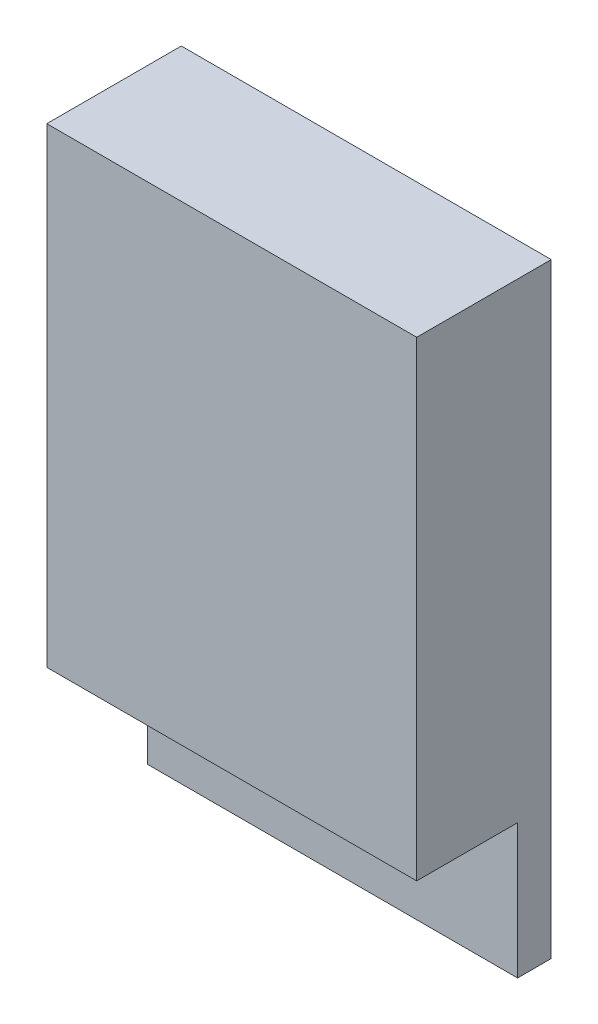
ISO-10303-21;
HEADER;
FILE_DESCRIPTION(('STEP AP214'),'2;1');
FILE_NAME('part.step','',(''),(''),'','','');
FILE_SCHEMA(('AUTOMOTIVE_DESIGN { 1 0 10303 214 1 1 1 1 }'));
ENDSEC;
DATA;
#1=APPLICATION_CONTEXT('core data for automotive mechanical design processes');
#2=APPLICATION_PROTOCOL_DEFINITION('international standard','automotive_design',2000,#1);
#3=PRODUCT_CONTEXT('',#1,'mechanical');
#4=PRODUCT('Part','Part','',(#3));
#5=PRODUCT_RELATED_PRODUCT_CATEGORY('part','',(#4));
#6=PRODUCT_DEFINITION_FORMATION('','',#4);
#7=PRODUCT_DEFINITION_CONTEXT('part definition',#1,'design');
#8=PRODUCT_DEFINITION('design','',#6,#7);
#9=PRODUCT_DEFINITION_SHAPE('','',#8);
#10=(LENGTH_UNIT() NAMED_UNIT(*) SI_UNIT(.MILLI.,.METRE.));
#11=(NAMED_UNIT(*) PLANE_ANGLE_UNIT() SI_UNIT($,.RADIAN.));
#12=(NAMED_UNIT(*) SI_UNIT($,.STERADIAN.) SOLID_ANGLE_UNIT());
#13=UNCERTAINTY_MEASURE_WITH_UNIT(LENGTH_MEASURE(1.E-05),#10,'distance_accuracy_value','');
#14=(GEOMETRIC_REPRESENTATION_CONTEXT(3) GLOBAL_UNCERTAINTY_ASSIGNED_CONTEXT((#13)) GLOBAL_UNIT_ASSIGNED_CONTEXT((#10,
#11,#12)) REPRESENTATION_CONTEXT('',''));
#15=CARTESIAN_POINT('',(0.,0.,0.));
#16=DIRECTION('',(0.,0.,1.));
#17=DIRECTION('',(1.,0.,0.));
#18=AXIS2_PLACEMENT_3D('',#15,#16,#17);
#19=CARTESIAN_POINT('',(-13.97,-22.86,2.54));
#20=DIRECTION('',(1.,0.,0.));
#21=DIRECTION('',(0.,0.,-1.));
#22=AXIS2_PLACEMENT_3D('',#19,#20,#21);
#23=PLANE('',#22);
#24=DIRECTION('',(0.,-1.,0.));
#25=VECTOR('',#24,1.);
#26=CARTESIAN_POINT('',(-13.97,-22.86,0.));
#27=LINE('',#26,#25);
#28=CARTESIAN_POINT('',(-13.97,22.86,0.));
#29=VERTEX_POINT('',#28);
#30=CARTESIAN_POINT('',(-13.97,-22.86,0.));
#31=VERTEX_POINT('',#30);
#32=EDGE_CURVE('E95',#29,#31,#27,.T.);
#33=ORIENTED_EDGE('',*,*,#32,.T.);
#34=DIRECTION('',(0.,0.,-1.));
#35=VECTOR('',#34,1.);
#36=CARTESIAN_POINT('',(-13.97,-22.86,2.54));
#37=LINE('',#36,#35);
#38=CARTESIAN_POINT('',(-13.97,-22.86,2.54));
#39=VERTEX_POINT('',#38);
#40=EDGE_CURVE('E11',#39,#31,#37,.T.);
#41=ORIENTED_EDGE('',*,*,#40,.F.);
#42=DIRECTION('',(0.,-1.,0.));
#43=VECTOR('',#42,1.);
#44=CARTESIAN_POINT('',(-13.97,-22.86,2.54));
#45=LINE('',#44,#43);
#46=CARTESIAN_POINT('',(-13.97,-12.7,2.54));
#47=VERTEX_POINT('',#46);
#48=EDGE_CURVE('E88',#47,#39,#45,.T.);
#49=ORIENTED_EDGE('',*,*,#48,.F.);
#50=DIRECTION('',(0.,0.,-1.));
#51=VECTOR('',#50,1.);
#52=CARTESIAN_POINT('',(-13.97,-12.7,10.16));
#53=LINE('',#52,#51);
#54=CARTESIAN_POINT('',(-13.97,-12.7,10.16));
#55=VERTEX_POINT('',#54);
#56=EDGE_CURVE('E103',#55,#47,#53,.T.);
#57=ORIENTED_EDGE('',*,*,#56,.F.);
#58=DIRECTION('',(0.,-1.,0.));
#59=VECTOR('',#58,1.);
#60=CARTESIAN_POINT('',(-13.97,22.86,10.16));
#61=LINE('',#60,#59);
#62=CARTESIAN_POINT('',(-13.97,22.86,10.16));
#63=VERTEX_POINT('',#62);
#64=EDGE_CURVE('E98',#63,#55,#61,.T.);
#65=ORIENTED_EDGE('',*,*,#64,.F.);
#66=DIRECTION('',(0.,0.,-1.));
#67=VECTOR('',#66,1.);
#68=CARTESIAN_POINT('',(-13.97,22.86,2.54));
#69=LINE('',#68,#67);
#70=EDGE_CURVE('E81',#63,#29,#69,.T.);
#71=ORIENTED_EDGE('',*,*,#70,.T.);
#72=EDGE_LOOP('',(#33,#41,#49,#57,#65,#71));
#73=FACE_BOUND('',#72,.T.);
#74=ADVANCED_FACE('F37',(#73),#23,.F.);
#75=CARTESIAN_POINT('',(13.97,-22.86,2.54));
#76=DIRECTION('',(0.,1.,0.));
#77=DIRECTION('',(-1.,0.,0.));
#78=AXIS2_PLACEMENT_3D('',#75,#76,#77);
#79=PLANE('',#78);
#80=DIRECTION('',(1.,0.,0.));
#81=VECTOR('',#80,1.);
#82=CARTESIAN_POINT('',(13.97,-22.86,0.));
#83=LINE('',#82,#81);
#84=CARTESIAN_POINT('',(13.97,-22.86,0.));
#85=VERTEX_POINT('',#84);
#86=EDGE_CURVE('E102',#31,#85,#83,.T.);
#87=ORIENTED_EDGE('',*,*,#86,.T.);
#88=DIRECTION('',(0.,0.,-1.));
#89=VECTOR('',#88,1.);
#90=CARTESIAN_POINT('',(13.97,-22.86,2.54));
#91=LINE('',#90,#89);
#92=CARTESIAN_POINT('',(13.97,-22.86,2.54));
#93=VERTEX_POINT('',#92);
#94=EDGE_CURVE('E44',#93,#85,#91,.T.);
#95=ORIENTED_EDGE('',*,*,#94,.F.);
#96=DIRECTION('',(1.,0.,0.));
#97=VECTOR('',#96,1.);
#98=CARTESIAN_POINT('',(13.97,-22.86,2.54));
#99=LINE('',#98,#97);
#100=EDGE_CURVE('E57',#39,#93,#99,.T.);
#101=ORIENTED_EDGE('',*,*,#100,.F.);
#102=ORIENTED_EDGE('',*,*,#40,.T.);
#103=EDGE_LOOP('',(#87,#95,#101,#102));
#104=FACE_BOUND('',#103,.T.);
#105=ADVANCED_FACE('F119',(#104),#79,.F.);
#106=CARTESIAN_POINT('',(13.97,-22.86,2.54));
#107=DIRECTION('',(-1.,0.,0.));
#108=DIRECTION('',(0.,0.,1.));
#109=AXIS2_PLACEMENT_3D('',#106,#107,#108);
#110=PLANE('',#109);
#111=DIRECTION('',(0.,1.,0.));
#112=VECTOR('',#111,1.);
#113=CARTESIAN_POINT('',(13.97,-22.86,0.));
#114=LINE('',#113,#112);
#115=CARTESIAN_POINT('',(13.97,22.86,0.));
#116=VERTEX_POINT('',#115);
#117=EDGE_CURVE('E89',#85,#116,#114,.T.);
#118=ORIENTED_EDGE('',*,*,#117,.T.);
#119=DIRECTION('',(0.,0.,-1.));
#120=VECTOR('',#119,1.);
#121=CARTESIAN_POINT('',(13.97,22.86,2.54));
#122=LINE('',#121,#120);
#123=CARTESIAN_POINT('',(13.97,22.86,10.16));
#124=VERTEX_POINT('',#123);
#125=EDGE_CURVE('E84',#124,#116,#122,.T.);
#126=ORIENTED_EDGE('',*,*,#125,.F.);
#127=DIRECTION('',(0.,1.,0.));
#128=VECTOR('',#127,1.);
#129=CARTESIAN_POINT('',(13.97,22.86,10.16));
#130=LINE('',#129,#128);
#131=CARTESIAN_POINT('',(13.97,-12.7,10.16));
#132=VERTEX_POINT('',#131);
#133=EDGE_CURVE('E134',#132,#124,#130,.T.);
#134=ORIENTED_EDGE('',*,*,#133,.F.);
#135=DIRECTION('',(0.,0.,-1.));
#136=VECTOR('',#135,1.);
#137=CARTESIAN_POINT('',(13.97,-12.7,10.16));
#138=LINE('',#137,#136);
#139=CARTESIAN_POINT('',(13.97,-12.7,2.54));
#140=VERTEX_POINT('',#139);
#141=EDGE_CURVE('E107',#132,#140,#138,.T.);
#142=ORIENTED_EDGE('',*,*,#141,.T.);
#143=DIRECTION('',(0.,1.,0.));
#144=VECTOR('',#143,1.);
#145=CARTESIAN_POINT('',(13.97,-22.86,2.54));
#146=LINE('',#145,#144);
#147=EDGE_CURVE('E99',#93,#140,#146,.T.);
#148=ORIENTED_EDGE('',*,*,#147,.F.);
#149=ORIENTED_EDGE('',*,*,#94,.T.);
#150=EDGE_LOOP('',(#118,#126,#134,#142,#148,#149));
#151=FACE_BOUND('',#150,.T.);
#152=ADVANCED_FACE('F116',(#151),#110,.F.);
#153=CARTESIAN_POINT('',(13.97,22.86,2.54));
#154=DIRECTION('',(0.,-1.,0.));
#155=DIRECTION('',(1.,0.,0.));
#156=AXIS2_PLACEMENT_3D('',#153,#154,#155);
#157=PLANE('',#156);
#158=DIRECTION('',(-1.,0.,0.));
#159=VECTOR('',#158,1.);
#160=CARTESIAN_POINT('',(13.97,22.86,0.));
#161=LINE('',#160,#159);
#162=EDGE_CURVE('E77',#116,#29,#161,.T.);
#163=ORIENTED_EDGE('',*,*,#162,.T.);
#164=ORIENTED_EDGE('',*,*,#70,.F.);
#165=DIRECTION('',(-1.,0.,0.));
#166=VECTOR('',#165,1.);
#167=CARTESIAN_POINT('',(-13.97,22.86,10.16));
#168=LINE('',#167,#166);
#169=EDGE_CURVE('E137',#124,#63,#168,.T.);
#170=ORIENTED_EDGE('',*,*,#169,.F.);
#171=ORIENTED_EDGE('',*,*,#125,.T.);
#172=EDGE_LOOP('',(#163,#164,#170,#171));
#173=FACE_BOUND('',#172,.T.);
#174=ADVANCED_FACE('F79',(#173),#157,.F.);
#175=CARTESIAN_POINT('',(0.,0.,2.54));
#176=DIRECTION('',(0.,0.,1.));
#177=DIRECTION('',(1.,0.,0.));
#178=AXIS2_PLACEMENT_3D('',#175,#176,#177);
#179=PLANE('',#178);
#180=DIRECTION('',(1.,0.,0.));
#181=VECTOR('',#180,1.);
#182=CARTESIAN_POINT('',(-13.97,-12.7,2.54));
#183=LINE('',#182,#181);
#184=EDGE_CURVE('E51',#47,#140,#183,.T.);
#185=ORIENTED_EDGE('',*,*,#184,.F.);
#186=ORIENTED_EDGE('',*,*,#48,.T.);
#187=ORIENTED_EDGE('',*,*,#100,.T.);
#188=ORIENTED_EDGE('',*,*,#147,.T.);
#189=EDGE_LOOP('',(#185,#186,#187,#188));
#190=FACE_BOUND('',#189,.T.);
#191=ADVANCED_FACE('F143',(#190),#179,.T.);
#192=CARTESIAN_POINT('',(0.,0.,0.));
#193=DIRECTION('',(0.,0.,1.));
#194=DIRECTION('',(1.,0.,0.));
#195=AXIS2_PLACEMENT_3D('',#192,#193,#194);
#196=PLANE('',#195);
#197=ORIENTED_EDGE('',*,*,#32,.F.);
#198=ORIENTED_EDGE('',*,*,#162,.F.);
#199=ORIENTED_EDGE('',*,*,#117,.F.);
#200=ORIENTED_EDGE('',*,*,#86,.F.);
#201=EDGE_LOOP('',(#197,#198,#199,#200));
#202=FACE_BOUND('',#201,.T.);
#203=ADVANCED_FACE('F101',(#202),#196,.F.);
#204=CARTESIAN_POINT('',(-13.97,-12.7,10.16));
#205=DIRECTION('',(0.,1.,0.));
#206=DIRECTION('',(0.,0.,1.));
#207=AXIS2_PLACEMENT_3D('',#204,#205,#206);
#208=PLANE('',#207);
#209=ORIENTED_EDGE('',*,*,#184,.T.);
#210=ORIENTED_EDGE('',*,*,#141,.F.);
#211=DIRECTION('',(1.,0.,0.));
#212=VECTOR('',#211,1.);
#213=CARTESIAN_POINT('',(-13.97,-12.7,10.16));
#214=LINE('',#213,#212);
#215=EDGE_CURVE('E128',#55,#132,#214,.T.);
#216=ORIENTED_EDGE('',*,*,#215,.F.);
#217=ORIENTED_EDGE('',*,*,#56,.T.);
#218=EDGE_LOOP('',(#209,#210,#216,#217));
#219=FACE_BOUND('',#218,.T.);
#220=ADVANCED_FACE('F124',(#219),#208,.F.);
#221=CARTESIAN_POINT('',(0.,0.,10.16));
#222=DIRECTION('',(0.,0.,1.));
#223=DIRECTION('',(1.,0.,0.));
#224=AXIS2_PLACEMENT_3D('',#221,#222,#223);
#225=PLANE('',#224);
#226=ORIENTED_EDGE('',*,*,#64,.T.);
#227=ORIENTED_EDGE('',*,*,#215,.T.);
#228=ORIENTED_EDGE('',*,*,#133,.T.);
#229=ORIENTED_EDGE('',*,*,#169,.T.);
#230=EDGE_LOOP('',(#226,#227,#228,#229));
#231=FACE_BOUND('',#230,.T.);
#232=ADVANCED_FACE('F136',(#231),#225,.T.);
#233=CLOSED_SHELL('',(#74,#105,#152,#174,#191,#203,#220,#232));
#234=MANIFOLD_SOLID_BREP('B2',#233);
#235=ADVANCED_BREP_SHAPE_REPRESENTATION('',(#18,#234),#14);
#236=SHAPE_DEFINITION_REPRESENTATION(#9,#235);
ENDSEC;
END-ISO-10303-21;
